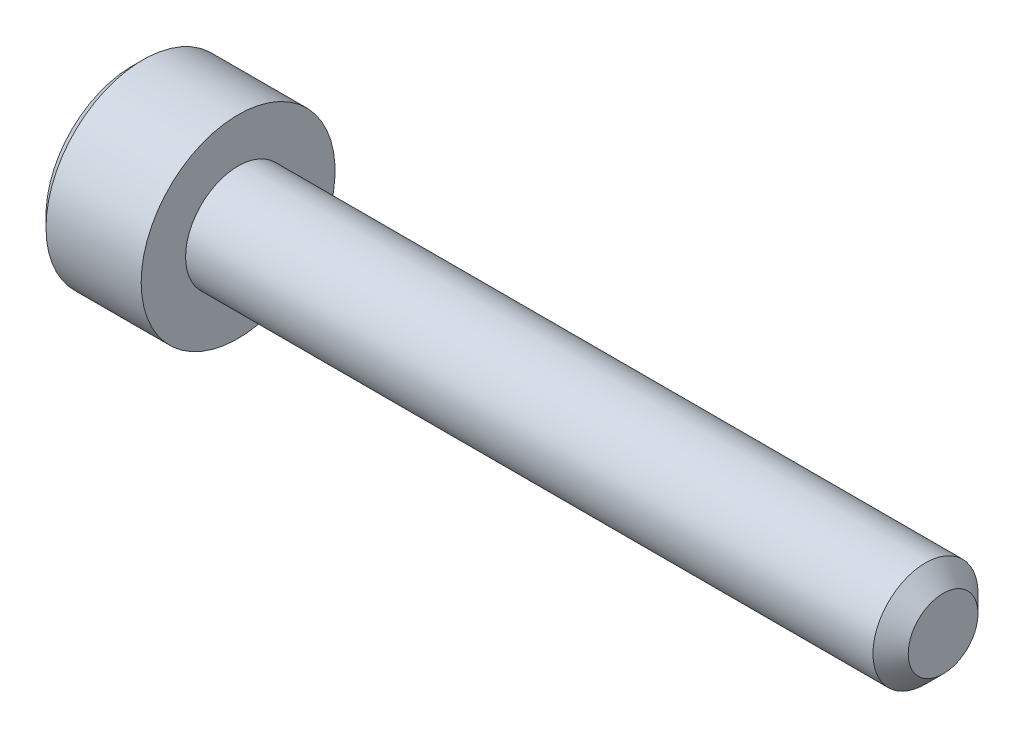
ISO-10303-21;
HEADER;
FILE_DESCRIPTION(('STEP AP214'),'2;1');
FILE_NAME('part.step','',(''),(''),'','','');
FILE_SCHEMA(('AUTOMOTIVE_DESIGN { 1 0 10303 214 1 1 1 1 }'));
ENDSEC;
DATA;
#1=APPLICATION_CONTEXT('core data for automotive mechanical design processes');
#2=APPLICATION_PROTOCOL_DEFINITION('international standard','automotive_design',2000,#1);
#3=PRODUCT_CONTEXT('',#1,'mechanical');
#4=PRODUCT('Part','Part','',(#3));
#5=PRODUCT_RELATED_PRODUCT_CATEGORY('part','',(#4));
#6=PRODUCT_DEFINITION_FORMATION('','',#4);
#7=PRODUCT_DEFINITION_CONTEXT('part definition',#1,'design');
#8=PRODUCT_DEFINITION('design','',#6,#7);
#9=PRODUCT_DEFINITION_SHAPE('','',#8);
#10=(LENGTH_UNIT() NAMED_UNIT(*) SI_UNIT(.MILLI.,.METRE.));
#11=(NAMED_UNIT(*) PLANE_ANGLE_UNIT() SI_UNIT($,.RADIAN.));
#12=(NAMED_UNIT(*) SI_UNIT($,.STERADIAN.) SOLID_ANGLE_UNIT());
#13=UNCERTAINTY_MEASURE_WITH_UNIT(LENGTH_MEASURE(1.E-05),#10,'distance_accuracy_value','');
#14=(GEOMETRIC_REPRESENTATION_CONTEXT(3) GLOBAL_UNCERTAINTY_ASSIGNED_CONTEXT((#13)) GLOBAL_UNIT_ASSIGNED_CONTEXT((#10,
#11,#12)) REPRESENTATION_CONTEXT('',''));
#15=CARTESIAN_POINT('',(0.,0.,0.));
#16=DIRECTION('',(0.,0.,1.));
#17=DIRECTION('',(1.,0.,0.));
#18=AXIS2_PLACEMENT_3D('',#15,#16,#17);
#19=CARTESIAN_POINT('',(0.,0.,0.));
#20=DIRECTION('',(1.,0.,0.));
#21=DIRECTION('',(0.,0.,-1.));
#22=AXIS2_PLACEMENT_3D('',#19,#20,#21);
#23=PLANE('',#22);
#24=DIRECTION('',(0.,0.866025403784439,0.5));
#25=VECTOR('',#24,1.);
#26=CARTESIAN_POINT('',(0.,1.4,-0.981495457622363));
#27=LINE('',#26,#25);
#28=CARTESIAN_POINT('',(0.,0.,-1.78978583448784));
#29=VERTEX_POINT('',#28);
#30=CARTESIAN_POINT('',(0.,1.55,-0.894892917243919));
#31=VERTEX_POINT('',#30);
#32=EDGE_CURVE('E154',#29,#31,#27,.T.);
#33=ORIENTED_EDGE('',*,*,#32,.T.);
#34=DIRECTION('',(0.,0.,1.));
#35=VECTOR('',#34,1.);
#36=CARTESIAN_POINT('',(0.,1.55,0.721687836487032));
#37=LINE('',#36,#35);
#38=CARTESIAN_POINT('',(0.,1.55,0.894892917243921));
#39=VERTEX_POINT('',#38);
#40=EDGE_CURVE('E164',#31,#39,#37,.T.);
#41=ORIENTED_EDGE('',*,*,#40,.T.);
#42=DIRECTION('',(0.,-0.866025403784439,0.5));
#43=VECTOR('',#42,1.);
#44=CARTESIAN_POINT('',(0.,0.150000000000001,1.7031832941094));
#45=LINE('',#44,#43);
#46=CARTESIAN_POINT('',(0.,0.,1.78978583448784));
#47=VERTEX_POINT('',#46);
#48=EDGE_CURVE('E162',#39,#47,#45,.T.);
#49=ORIENTED_EDGE('',*,*,#48,.T.);
#50=DIRECTION('',(0.,-0.866025403784439,-0.5));
#51=VECTOR('',#50,1.);
#52=CARTESIAN_POINT('',(0.,-1.4,0.981495457622366));
#53=LINE('',#52,#51);
#54=CARTESIAN_POINT('',(0.,-1.55,0.894892917243921));
#55=VERTEX_POINT('',#54);
#56=EDGE_CURVE('E160',#47,#55,#53,.T.);
#57=ORIENTED_EDGE('',*,*,#56,.T.);
#58=DIRECTION('',(0.,0.,-1.));
#59=VECTOR('',#58,1.);
#60=CARTESIAN_POINT('',(0.,-1.55,-0.721687836487031));
#61=LINE('',#60,#59);
#62=CARTESIAN_POINT('',(0.,-1.55,-0.89489291724392));
#63=VERTEX_POINT('',#62);
#64=EDGE_CURVE('E158',#55,#63,#61,.T.);
#65=ORIENTED_EDGE('',*,*,#64,.T.);
#66=DIRECTION('',(0.,0.866025403784439,-0.5));
#67=VECTOR('',#66,1.);
#68=CARTESIAN_POINT('',(0.,-0.15,-1.7031832941094));
#69=LINE('',#68,#67);
#70=EDGE_CURVE('E156',#63,#29,#69,.T.);
#71=ORIENTED_EDGE('',*,*,#70,.T.);
#72=EDGE_LOOP('',(#33,#41,#49,#57,#65,#71));
#73=FACE_BOUND('',#72,.T.);
#74=CARTESIAN_POINT('',(0.,0.,0.));
#75=DIRECTION('',(1.,0.,0.));
#76=DIRECTION('',(0.,0.,-1.));
#77=AXIS2_PLACEMENT_3D('',#74,#75,#76);
#78=CIRCLE('',#77,2.45);
#79=CARTESIAN_POINT('',(0.,0.,-2.45));
#80=VERTEX_POINT('',#79);
#81=EDGE_CURVE('E148',#80,#80,#78,.F.);
#82=ORIENTED_EDGE('',*,*,#81,.T.);
#83=EDGE_LOOP('',(#82));
#84=FACE_BOUND('',#83,.T.);
#85=ADVANCED_FACE('F33',(#73,#84),#23,.F.);
#86=CARTESIAN_POINT('',(23.,0.,0.));
#87=DIRECTION('',(-1.,0.,0.));
#88=DIRECTION('',(0.,0.,1.));
#89=AXIS2_PLACEMENT_3D('',#86,#87,#88);
#90=PLANE('',#89);
#91=CARTESIAN_POINT('',(23.,0.,0.));
#92=DIRECTION('',(-1.,0.,0.));
#93=DIRECTION('',(0.,0.,1.));
#94=AXIS2_PLACEMENT_3D('',#91,#92,#93);
#95=CIRCLE('',#94,0.989999999999974);
#96=CARTESIAN_POINT('',(23.,0.,0.989999999999974));
#97=VERTEX_POINT('',#96);
#98=EDGE_CURVE('E145',#97,#97,#95,.F.);
#99=ORIENTED_EDGE('',*,*,#98,.T.);
#100=EDGE_LOOP('',(#99));
#101=FACE_BOUND('',#100,.T.);
#102=ADVANCED_FACE('F244',(#101),#90,.F.);
#103=CARTESIAN_POINT('',(-88.7054908485857,0.,0.));
#104=DIRECTION('',(-1.,0.,0.));
#105=DIRECTION('',(0.,0.,1.));
#106=AXIS2_PLACEMENT_3D('',#103,#104,#105);
#107=CYLINDRICAL_SURFACE('',#106,1.49);
#108=CARTESIAN_POINT('',(22.5,0.,0.));
#109=DIRECTION('',(-1.,0.,0.));
#110=DIRECTION('',(0.,0.,1.));
#111=AXIS2_PLACEMENT_3D('',#108,#109,#110);
#112=CIRCLE('',#111,1.49);
#113=CARTESIAN_POINT('',(22.5,0.,1.49));
#114=VERTEX_POINT('',#113);
#115=EDGE_CURVE('E142',#114,#114,#112,.T.);
#116=ORIENTED_EDGE('',*,*,#115,.T.);
#117=EDGE_LOOP('',(#116));
#118=FACE_BOUND('',#117,.T.);
#119=CARTESIAN_POINT('',(3.,0.,0.));
#120=DIRECTION('',(-1.,0.,0.));
#121=DIRECTION('',(0.,0.,1.));
#122=AXIS2_PLACEMENT_3D('',#119,#120,#121);
#123=CIRCLE('',#122,1.49);
#124=CARTESIAN_POINT('',(3.,0.,1.49));
#125=VERTEX_POINT('',#124);
#126=EDGE_CURVE('E134',#125,#125,#123,.T.);
#127=ORIENTED_EDGE('',*,*,#126,.F.);
#128=EDGE_LOOP('',(#127));
#129=FACE_BOUND('',#128,.T.);
#130=ADVANCED_FACE('F249',(#118,#129),#107,.T.);
#131=CARTESIAN_POINT('',(3.,1.49,0.));
#132=DIRECTION('',(-1.,0.,0.));
#133=DIRECTION('',(0.,0.,1.));
#134=AXIS2_PLACEMENT_3D('',#131,#132,#133);
#135=PLANE('',#134);
#136=CARTESIAN_POINT('',(3.,0.,0.));
#137=DIRECTION('',(-1.,0.,0.));
#138=DIRECTION('',(0.,0.,1.));
#139=AXIS2_PLACEMENT_3D('',#136,#137,#138);
#140=CIRCLE('',#139,2.75);
#141=CARTESIAN_POINT('',(3.,0.,2.75));
#142=VERTEX_POINT('',#141);
#143=EDGE_CURVE('E130',#142,#142,#140,.T.);
#144=ORIENTED_EDGE('',*,*,#143,.F.);
#145=EDGE_LOOP('',(#144));
#146=FACE_BOUND('',#145,.T.);
#147=ORIENTED_EDGE('',*,*,#126,.T.);
#148=EDGE_LOOP('',(#147));
#149=FACE_BOUND('',#148,.T.);
#150=ADVANCED_FACE('F259',(#146,#149),#135,.F.);
#151=CARTESIAN_POINT('',(-88.7054908485857,0.,0.));
#152=DIRECTION('',(-1.,0.,0.));
#153=DIRECTION('',(0.,0.,1.));
#154=AXIS2_PLACEMENT_3D('',#151,#152,#153);
#155=CYLINDRICAL_SURFACE('',#154,2.75);
#156=CARTESIAN_POINT('',(0.300000000000009,0.,0.));
#157=DIRECTION('',(1.,0.,0.));
#158=DIRECTION('',(0.,0.,-1.));
#159=AXIS2_PLACEMENT_3D('',#156,#157,#158);
#160=CIRCLE('',#159,2.75);
#161=CARTESIAN_POINT('',(0.300000000000009,0.,-2.75));
#162=VERTEX_POINT('',#161);
#163=EDGE_CURVE('E151',#162,#162,#160,.T.);
#164=ORIENTED_EDGE('',*,*,#163,.T.);
#165=EDGE_LOOP('',(#164));
#166=FACE_BOUND('',#165,.T.);
#167=ORIENTED_EDGE('',*,*,#143,.T.);
#168=EDGE_LOOP('',(#167));
#169=FACE_BOUND('',#168,.T.);
#170=ADVANCED_FACE('F255',(#166,#169),#155,.T.);
#171=CARTESIAN_POINT('',(22.5,0.,0.));
#172=DIRECTION('',(-1.,0.,0.));
#173=DIRECTION('',(0.,0.,1.));
#174=AXIS2_PLACEMENT_3D('',#171,#172,#173);
#175=CONICAL_SURFACE('',#174,1.49,0.785398163397466);
#176=ORIENTED_EDGE('',*,*,#98,.F.);
#177=EDGE_LOOP('',(#176));
#178=FACE_BOUND('',#177,.T.);
#179=ORIENTED_EDGE('',*,*,#115,.F.);
#180=EDGE_LOOP('',(#179));
#181=FACE_BOUND('',#180,.T.);
#182=ADVANCED_FACE('F258',(#178,#181),#175,.T.);
#183=CARTESIAN_POINT('',(0.,0.,0.));
#184=DIRECTION('',(1.,0.,0.));
#185=DIRECTION('',(0.,0.,-1.));
#186=AXIS2_PLACEMENT_3D('',#183,#184,#185);
#187=CONICAL_SURFACE('',#186,2.45,0.785398163397438);
#188=ORIENTED_EDGE('',*,*,#163,.F.);
#189=EDGE_LOOP('',(#188));
#190=FACE_BOUND('',#189,.T.);
#191=ORIENTED_EDGE('',*,*,#81,.F.);
#192=EDGE_LOOP('',(#191));
#193=FACE_BOUND('',#192,.T.);
#194=ADVANCED_FACE('F269',(#190,#193),#187,.T.);
#195=CARTESIAN_POINT('',(2.5,1.25,0.721687836487032));
#196=DIRECTION('',(0.,-0.5,-0.866025403784438));
#197=DIRECTION('',(0.,0.866025403784439,-0.5));
#198=AXIS2_PLACEMENT_3D('',#195,#196,#197);
#199=PLANE('',#198);
#200=DIRECTION('',(-1.,0.,0.));
#201=VECTOR('',#200,1.);
#202=CARTESIAN_POINT('',(2.5,0.,1.44337567297407));
#203=LINE('',#202,#201);
#204=CARTESIAN_POINT('',(2.5,0.,1.44337567297407));
#205=VERTEX_POINT('',#204);
#206=CARTESIAN_POINT('',(0.299999999999998,0.,1.44337567297407));
#207=VERTEX_POINT('',#206);
#208=EDGE_CURVE('E122',#205,#207,#203,.T.);
#209=ORIENTED_EDGE('',*,*,#208,.T.);
#210=DIRECTION('',(0.,0.866025403784439,-0.5));
#211=VECTOR('',#210,1.);
#212=CARTESIAN_POINT('',(0.299999999999998,1.25,0.721687836487032));
#213=LINE('',#212,#211);
#214=CARTESIAN_POINT('',(0.299999999999998,1.25,0.721687836487032));
#215=VERTEX_POINT('',#214);
#216=EDGE_CURVE('E170',#207,#215,#213,.T.);
#217=ORIENTED_EDGE('',*,*,#216,.T.);
#218=DIRECTION('',(-1.,0.,0.));
#219=VECTOR('',#218,1.);
#220=CARTESIAN_POINT('',(2.5,1.25,0.721687836487032));
#221=LINE('',#220,#219);
#222=CARTESIAN_POINT('',(2.5,1.25,0.721687836487032));
#223=VERTEX_POINT('',#222);
#224=EDGE_CURVE('E125',#223,#215,#221,.T.);
#225=ORIENTED_EDGE('',*,*,#224,.F.);
#226=DIRECTION('',(0.,-0.866025403784439,0.5));
#227=VECTOR('',#226,1.);
#228=CARTESIAN_POINT('',(2.5,1.25,0.721687836487032));
#229=LINE('',#228,#227);
#230=EDGE_CURVE('E110',#223,#205,#229,.T.);
#231=ORIENTED_EDGE('',*,*,#230,.T.);
#232=EDGE_LOOP('',(#209,#217,#225,#231));
#233=FACE_BOUND('',#232,.T.);
#234=ADVANCED_FACE('F121',(#233),#199,.T.);
#235=CARTESIAN_POINT('',(2.5,0.,1.44337567297407));
#236=DIRECTION('',(0.,0.5,-0.866025403784438));
#237=DIRECTION('',(0.,0.866025403784439,0.5));
#238=AXIS2_PLACEMENT_3D('',#235,#236,#237);
#239=PLANE('',#238);
#240=DIRECTION('',(-1.,0.,0.));
#241=VECTOR('',#240,1.);
#242=CARTESIAN_POINT('',(2.5,-1.25,0.721687836487033));
#243=LINE('',#242,#241);
#244=CARTESIAN_POINT('',(2.5,-1.25,0.721687836487033));
#245=VERTEX_POINT('',#244);
#246=CARTESIAN_POINT('',(0.299999999999998,-1.25,0.721687836487033));
#247=VERTEX_POINT('',#246);
#248=EDGE_CURVE('E131',#245,#247,#243,.T.);
#249=ORIENTED_EDGE('',*,*,#248,.T.);
#250=DIRECTION('',(0.,0.866025403784439,0.5));
#251=VECTOR('',#250,1.);
#252=CARTESIAN_POINT('',(0.299999999999998,0.,1.44337567297407));
#253=LINE('',#252,#251);
#254=EDGE_CURVE('E129',#247,#207,#253,.T.);
#255=ORIENTED_EDGE('',*,*,#254,.T.);
#256=ORIENTED_EDGE('',*,*,#208,.F.);
#257=DIRECTION('',(0.,-0.866025403784439,-0.5));
#258=VECTOR('',#257,1.);
#259=CARTESIAN_POINT('',(2.5,0.,1.44337567297407));
#260=LINE('',#259,#258);
#261=EDGE_CURVE('E106',#205,#245,#260,.T.);
#262=ORIENTED_EDGE('',*,*,#261,.T.);
#263=EDGE_LOOP('',(#249,#255,#256,#262));
#264=FACE_BOUND('',#263,.T.);
#265=ADVANCED_FACE('F127',(#264),#239,.T.);
#266=CARTESIAN_POINT('',(2.5,-1.25,0.721687836487033));
#267=DIRECTION('',(0.,1.,0.));
#268=DIRECTION('',(0.,0.,1.));
#269=AXIS2_PLACEMENT_3D('',#266,#267,#268);
#270=PLANE('',#269);
#271=DIRECTION('',(-1.,0.,0.));
#272=VECTOR('',#271,1.);
#273=CARTESIAN_POINT('',(2.5,-1.25,-0.721687836487031));
#274=LINE('',#273,#272);
#275=CARTESIAN_POINT('',(2.5,-1.25,-0.721687836487031));
#276=VERTEX_POINT('',#275);
#277=CARTESIAN_POINT('',(0.299999999999998,-1.25,-0.721687836487031));
#278=VERTEX_POINT('',#277);
#279=EDGE_CURVE('E136',#276,#278,#274,.T.);
#280=ORIENTED_EDGE('',*,*,#279,.T.);
#281=DIRECTION('',(0.,0.,1.));
#282=VECTOR('',#281,1.);
#283=CARTESIAN_POINT('',(0.299999999999998,-1.25,0.721687836487033));
#284=LINE('',#283,#282);
#285=EDGE_CURVE('E173',#278,#247,#284,.T.);
#286=ORIENTED_EDGE('',*,*,#285,.T.);
#287=ORIENTED_EDGE('',*,*,#248,.F.);
#288=DIRECTION('',(0.,0.,-1.));
#289=VECTOR('',#288,1.);
#290=CARTESIAN_POINT('',(2.5,-1.25,0.721687836487033));
#291=LINE('',#290,#289);
#292=EDGE_CURVE('E112',#245,#276,#291,.T.);
#293=ORIENTED_EDGE('',*,*,#292,.T.);
#294=EDGE_LOOP('',(#280,#286,#287,#293));
#295=FACE_BOUND('',#294,.T.);
#296=ADVANCED_FACE('F200',(#295),#270,.T.);
#297=CARTESIAN_POINT('',(2.5,-1.25,-0.721687836487031));
#298=DIRECTION('',(0.,0.5,0.866025403784439));
#299=DIRECTION('',(0.,-0.866025403784439,0.5));
#300=AXIS2_PLACEMENT_3D('',#297,#298,#299);
#301=PLANE('',#300);
#302=DIRECTION('',(-1.,0.,0.));
#303=VECTOR('',#302,1.);
#304=CARTESIAN_POINT('',(2.5,0.,-1.44337567297406));
#305=LINE('',#304,#303);
#306=CARTESIAN_POINT('',(2.5,0.,-1.44337567297406));
#307=VERTEX_POINT('',#306);
#308=CARTESIAN_POINT('',(0.299999999999998,0.,-1.44337567297406));
#309=VERTEX_POINT('',#308);
#310=EDGE_CURVE('E201',#307,#309,#305,.T.);
#311=ORIENTED_EDGE('',*,*,#310,.T.);
#312=DIRECTION('',(0.,-0.866025403784439,0.5));
#313=VECTOR('',#312,1.);
#314=CARTESIAN_POINT('',(0.299999999999998,-1.25,-0.721687836487031));
#315=LINE('',#314,#313);
#316=EDGE_CURVE('E42',#309,#278,#315,.T.);
#317=ORIENTED_EDGE('',*,*,#316,.T.);
#318=ORIENTED_EDGE('',*,*,#279,.F.);
#319=DIRECTION('',(0.,0.866025403784439,-0.499999999999999));
#320=VECTOR('',#319,1.);
#321=CARTESIAN_POINT('',(2.5,-1.25,-0.721687836487031));
#322=LINE('',#321,#320);
#323=EDGE_CURVE('E211',#276,#307,#322,.T.);
#324=ORIENTED_EDGE('',*,*,#323,.T.);
#325=EDGE_LOOP('',(#311,#317,#318,#324));
#326=FACE_BOUND('',#325,.T.);
#327=ADVANCED_FACE('F213',(#326),#301,.T.);
#328=CARTESIAN_POINT('',(2.5,0.,-1.44337567297406));
#329=DIRECTION('',(0.,-0.5,0.866025403784439));
#330=DIRECTION('',(0.,-0.866025403784439,-0.5));
#331=AXIS2_PLACEMENT_3D('',#328,#329,#330);
#332=PLANE('',#331);
#333=DIRECTION('',(-1.,0.,0.));
#334=VECTOR('',#333,1.);
#335=CARTESIAN_POINT('',(2.5,1.25,-0.72168783648703));
#336=LINE('',#335,#334);
#337=CARTESIAN_POINT('',(2.5,1.25,-0.72168783648703));
#338=VERTEX_POINT('',#337);
#339=CARTESIAN_POINT('',(0.299999999999998,1.25,-0.72168783648703));
#340=VERTEX_POINT('',#339);
#341=EDGE_CURVE('E202',#338,#340,#336,.T.);
#342=ORIENTED_EDGE('',*,*,#341,.T.);
#343=DIRECTION('',(0.,-0.866025403784439,-0.5));
#344=VECTOR('',#343,1.);
#345=CARTESIAN_POINT('',(0.299999999999998,0.,-1.44337567297406));
#346=LINE('',#345,#344);
#347=EDGE_CURVE('E11',#340,#309,#346,.T.);
#348=ORIENTED_EDGE('',*,*,#347,.T.);
#349=ORIENTED_EDGE('',*,*,#310,.F.);
#350=DIRECTION('',(0.,0.866025403784438,0.5));
#351=VECTOR('',#350,1.);
#352=CARTESIAN_POINT('',(2.5,0.,-1.44337567297406));
#353=LINE('',#352,#351);
#354=EDGE_CURVE('E209',#307,#338,#353,.T.);
#355=ORIENTED_EDGE('',*,*,#354,.T.);
#356=EDGE_LOOP('',(#342,#348,#349,#355));
#357=FACE_BOUND('',#356,.T.);
#358=ADVANCED_FACE('F215',(#357),#332,.T.);
#359=CARTESIAN_POINT('',(2.5,1.25,-0.72168783648703));
#360=DIRECTION('',(0.,-1.,0.));
#361=DIRECTION('',(0.,0.,-1.));
#362=AXIS2_PLACEMENT_3D('',#359,#360,#361);
#363=PLANE('',#362);
#364=ORIENTED_EDGE('',*,*,#224,.T.);
#365=DIRECTION('',(0.,0.,-1.));
#366=VECTOR('',#365,1.);
#367=CARTESIAN_POINT('',(0.299999999999998,1.25,-0.72168783648703));
#368=LINE('',#367,#366);
#369=EDGE_CURVE('E167',#215,#340,#368,.T.);
#370=ORIENTED_EDGE('',*,*,#369,.T.);
#371=ORIENTED_EDGE('',*,*,#341,.F.);
#372=DIRECTION('',(0.,0.,1.));
#373=VECTOR('',#372,1.);
#374=CARTESIAN_POINT('',(2.5,1.25,-0.72168783648703));
#375=LINE('',#374,#373);
#376=EDGE_CURVE('E207',#338,#223,#375,.T.);
#377=ORIENTED_EDGE('',*,*,#376,.T.);
#378=EDGE_LOOP('',(#364,#370,#371,#377));
#379=FACE_BOUND('',#378,.T.);
#380=ADVANCED_FACE('F218',(#379),#363,.T.);
#381=CARTESIAN_POINT('',(2.5,0.,0.));
#382=DIRECTION('',(1.,0.,0.));
#383=DIRECTION('',(0.,0.,-1.));
#384=AXIS2_PLACEMENT_3D('',#381,#382,#383);
#385=PLANE('',#384);
#386=ORIENTED_EDGE('',*,*,#230,.F.);
#387=ORIENTED_EDGE('',*,*,#376,.F.);
#388=ORIENTED_EDGE('',*,*,#354,.F.);
#389=ORIENTED_EDGE('',*,*,#323,.F.);
#390=ORIENTED_EDGE('',*,*,#292,.F.);
#391=ORIENTED_EDGE('',*,*,#261,.F.);
#392=EDGE_LOOP('',(#386,#387,#388,#389,#390,#391));
#393=FACE_BOUND('',#392,.T.);
#394=ADVANCED_FACE('F108',(#393),#385,.F.);
#395=CARTESIAN_POINT('',(0.,-1.55,0.));
#396=DIRECTION('',(-0.707106781186552,0.707106781186543,0.));
#397=DIRECTION('',(0.,0.,1.));
#398=AXIS2_PLACEMENT_3D('',#395,#396,#397);
#399=PLANE('',#398);
#400=DIRECTION('',(0.654653670707973,0.654653670707981,-0.377964473009229));
#401=VECTOR('',#400,1.);
#402=CARTESIAN_POINT('',(0.221428571428571,-1.32857142857143,0.76705107192336));
#403=LINE('',#402,#401);
#404=EDGE_CURVE('E185',#247,#55,#403,.F.);
#405=ORIENTED_EDGE('',*,*,#404,.F.);
#406=ORIENTED_EDGE('',*,*,#285,.F.);
#407=DIRECTION('',(0.654653670707973,0.654653670707981,0.377964473009229));
#408=VECTOR('',#407,1.);
#409=CARTESIAN_POINT('',(0.221428571428571,-1.32857142857143,-0.767051071923359));
#410=LINE('',#409,#408);
#411=EDGE_CURVE('E37',#63,#278,#410,.T.);
#412=ORIENTED_EDGE('',*,*,#411,.F.);
#413=ORIENTED_EDGE('',*,*,#64,.F.);
#414=EDGE_LOOP('',(#405,#406,#412,#413));
#415=FACE_BOUND('',#414,.T.);
#416=ADVANCED_FACE('F35',(#415),#399,.T.);
#417=CARTESIAN_POINT('',(0.,-0.775,-1.34233937586588));
#418=DIRECTION('',(-0.707106781186552,0.353553390593271,0.612372435695791));
#419=DIRECTION('',(0.,-0.866025403784439,0.5));
#420=AXIS2_PLACEMENT_3D('',#417,#418,#419);
#421=PLANE('',#420);
#422=ORIENTED_EDGE('',*,*,#411,.T.);
#423=ORIENTED_EDGE('',*,*,#316,.F.);
#424=DIRECTION('',(0.654653670707973,0.,0.755928946018458));
#425=VECTOR('',#424,1.);
#426=CARTESIAN_POINT('',(0.221428571428571,0.,-1.53410214384672));
#427=LINE('',#426,#425);
#428=EDGE_CURVE('E183',#29,#309,#427,.T.);
#429=ORIENTED_EDGE('',*,*,#428,.F.);
#430=ORIENTED_EDGE('',*,*,#70,.F.);
#431=EDGE_LOOP('',(#422,#423,#429,#430));
#432=FACE_BOUND('',#431,.T.);
#433=ADVANCED_FACE('F194',(#432),#421,.T.);
#434=CARTESIAN_POINT('',(0.,-0.775000000000002,1.34233937586588));
#435=DIRECTION('',(-0.707106781186552,0.353553390593272,-0.612372435695791));
#436=DIRECTION('',(0.,0.866025403784439,0.5));
#437=AXIS2_PLACEMENT_3D('',#434,#435,#436);
#438=PLANE('',#437);
#439=ORIENTED_EDGE('',*,*,#404,.T.);
#440=ORIENTED_EDGE('',*,*,#56,.F.);
#441=DIRECTION('',(0.654653670707973,0.,-0.755928946018458));
#442=VECTOR('',#441,1.);
#443=CARTESIAN_POINT('',(0.221428571428572,0.,1.53410214384672));
#444=LINE('',#443,#442);
#445=EDGE_CURVE('E180',#207,#47,#444,.F.);
#446=ORIENTED_EDGE('',*,*,#445,.F.);
#447=ORIENTED_EDGE('',*,*,#254,.F.);
#448=EDGE_LOOP('',(#439,#440,#446,#447));
#449=FACE_BOUND('',#448,.T.);
#450=ADVANCED_FACE('F235',(#449),#438,.T.);
#451=CARTESIAN_POINT('',(0.,0.775000000000001,-1.34233937586588));
#452=DIRECTION('',(-0.707106781186552,-0.353553390593272,0.612372435695791));
#453=DIRECTION('',(0.,-0.866025403784439,-0.5));
#454=AXIS2_PLACEMENT_3D('',#451,#452,#453);
#455=PLANE('',#454);
#456=ORIENTED_EDGE('',*,*,#428,.T.);
#457=ORIENTED_EDGE('',*,*,#347,.F.);
#458=DIRECTION('',(-0.654653670707973,0.654653670707981,-0.377964473009229));
#459=VECTOR('',#458,1.);
#460=CARTESIAN_POINT('',(0.221428571428571,1.32857142857143,-0.767051071923358));
#461=LINE('',#460,#459);
#462=EDGE_CURVE('E178',#31,#340,#461,.F.);
#463=ORIENTED_EDGE('',*,*,#462,.F.);
#464=ORIENTED_EDGE('',*,*,#32,.F.);
#465=EDGE_LOOP('',(#456,#457,#463,#464));
#466=FACE_BOUND('',#465,.T.);
#467=ADVANCED_FACE('F233',(#466),#455,.T.);
#468=CARTESIAN_POINT('',(0.,0.775000000000001,1.34233937586588));
#469=DIRECTION('',(-0.707106781186552,-0.353553390593272,-0.612372435695791));
#470=DIRECTION('',(0.,0.866025403784439,-0.5));
#471=AXIS2_PLACEMENT_3D('',#468,#469,#470);
#472=PLANE('',#471);
#473=ORIENTED_EDGE('',*,*,#445,.T.);
#474=ORIENTED_EDGE('',*,*,#48,.F.);
#475=DIRECTION('',(0.654653670707973,-0.654653670707981,-0.377964473009229));
#476=VECTOR('',#475,1.);
#477=CARTESIAN_POINT('',(0.221428571428571,1.32857142857143,0.767051071923359));
#478=LINE('',#477,#476);
#479=EDGE_CURVE('E176',#215,#39,#478,.F.);
#480=ORIENTED_EDGE('',*,*,#479,.F.);
#481=ORIENTED_EDGE('',*,*,#216,.F.);
#482=EDGE_LOOP('',(#473,#474,#480,#481));
#483=FACE_BOUND('',#482,.T.);
#484=ADVANCED_FACE('F228',(#483),#472,.T.);
#485=CARTESIAN_POINT('',(0.,1.55,0.));
#486=DIRECTION('',(-0.707106781186552,-0.707106781186543,0.));
#487=DIRECTION('',(0.,0.,-1.));
#488=AXIS2_PLACEMENT_3D('',#485,#486,#487);
#489=PLANE('',#488);
#490=ORIENTED_EDGE('',*,*,#462,.T.);
#491=ORIENTED_EDGE('',*,*,#369,.F.);
#492=ORIENTED_EDGE('',*,*,#479,.T.);
#493=ORIENTED_EDGE('',*,*,#40,.F.);
#494=EDGE_LOOP('',(#490,#491,#492,#493));
#495=FACE_BOUND('',#494,.T.);
#496=ADVANCED_FACE('F222',(#495),#489,.T.);
#497=CLOSED_SHELL('',(#85,#102,#130,#150,#170,#182,#194,#234,#265,#296,#327,#358,#380,#394,#416,
#433,#450,#467,#484,#496));
#498=MANIFOLD_SOLID_BREP('B2',#497);
#499=ADVANCED_BREP_SHAPE_REPRESENTATION('',(#18,#498),#14);
#500=SHAPE_DEFINITION_REPRESENTATION(#9,#499);
ENDSEC;
END-ISO-10303-21;
